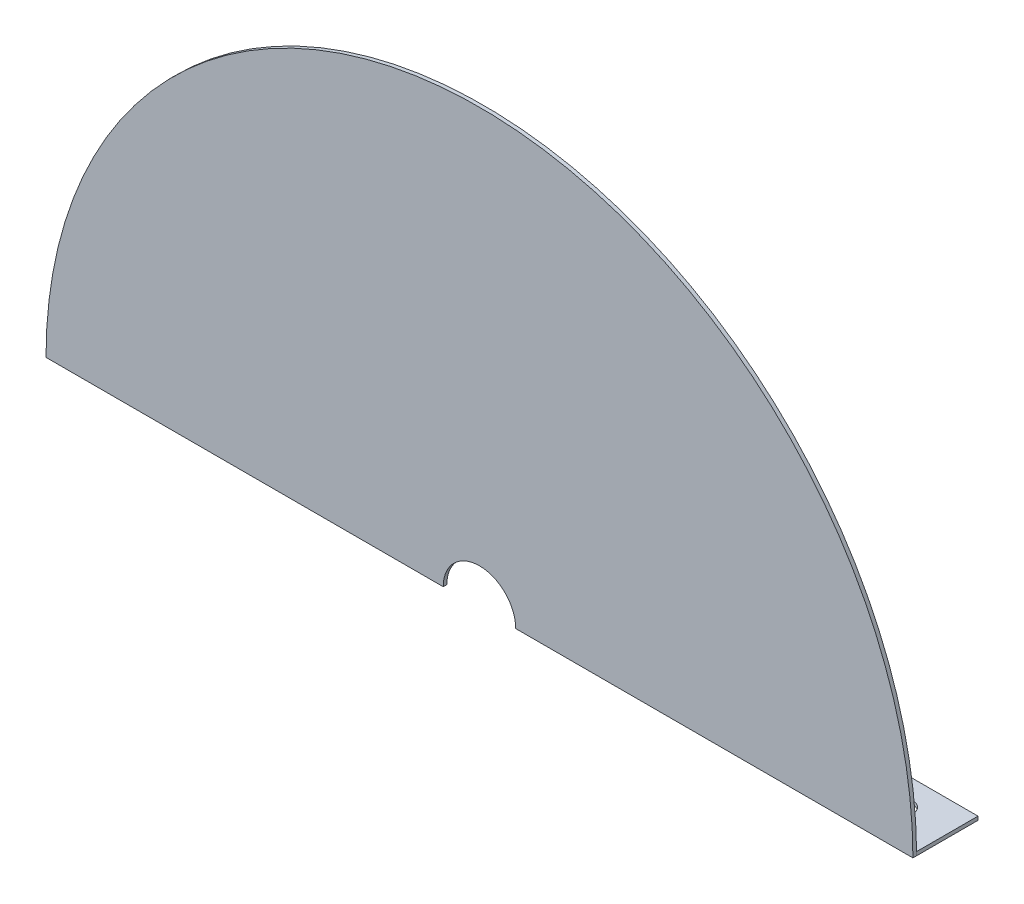
ISO-10303-21;
HEADER;
FILE_DESCRIPTION(('STEP AP214'),'2;1');
FILE_NAME('part.step','',(''),(''),'','','');
FILE_SCHEMA(('AUTOMOTIVE_DESIGN { 1 0 10303 214 1 1 1 1 }'));
ENDSEC;
DATA;
#1=APPLICATION_CONTEXT('core data for automotive mechanical design processes');
#2=APPLICATION_PROTOCOL_DEFINITION('international standard','automotive_design',2000,#1);
#3=PRODUCT_CONTEXT('',#1,'mechanical');
#4=PRODUCT('Part','Part','',(#3));
#5=PRODUCT_RELATED_PRODUCT_CATEGORY('part','',(#4));
#6=PRODUCT_DEFINITION_FORMATION('','',#4);
#7=PRODUCT_DEFINITION_CONTEXT('part definition',#1,'design');
#8=PRODUCT_DEFINITION('design','',#6,#7);
#9=PRODUCT_DEFINITION_SHAPE('','',#8);
#10=(LENGTH_UNIT() NAMED_UNIT(*) SI_UNIT(.MILLI.,.METRE.));
#11=(NAMED_UNIT(*) PLANE_ANGLE_UNIT() SI_UNIT($,.RADIAN.));
#12=(NAMED_UNIT(*) SI_UNIT($,.STERADIAN.) SOLID_ANGLE_UNIT());
#13=UNCERTAINTY_MEASURE_WITH_UNIT(LENGTH_MEASURE(1.E-05),#10,'distance_accuracy_value','');
#14=(GEOMETRIC_REPRESENTATION_CONTEXT(3) GLOBAL_UNCERTAINTY_ASSIGNED_CONTEXT((#13)) GLOBAL_UNIT_ASSIGNED_CONTEXT((#10,
#11,#12)) REPRESENTATION_CONTEXT('',''));
#15=CARTESIAN_POINT('',(0.,0.,0.));
#16=DIRECTION('',(0.,0.,1.));
#17=DIRECTION('',(1.,0.,0.));
#18=AXIS2_PLACEMENT_3D('',#15,#16,#17);
#19=CARTESIAN_POINT('',(0.,179.31892,0.));
#20=DIRECTION('',(0.,0.,-1.));
#21=DIRECTION('',(-1.,0.,0.));
#22=AXIS2_PLACEMENT_3D('',#19,#20,#21);
#23=PLANE('',#22);
#24=DIRECTION('',(0.,-1.,0.));
#25=VECTOR('',#24,1.);
#26=CARTESIAN_POINT('',(-103.11892,179.31892,0.));
#27=LINE('',#26,#25);
#28=CARTESIAN_POINT('',(-103.11892,180.83784,0.));
#29=VERTEX_POINT('',#28);
#30=CARTESIAN_POINT('',(-103.11892,179.31892,0.));
#31=VERTEX_POINT('',#30);
#32=EDGE_CURVE('E152',#29,#31,#27,.T.);
#33=ORIENTED_EDGE('',*,*,#32,.F.);
#34=DIRECTION('',(-1.,0.,0.));
#35=VECTOR('',#34,1.);
#36=CARTESIAN_POINT('',(0.,180.83784,0.));
#37=LINE('',#36,#35);
#38=CARTESIAN_POINT('',(-179.312486882537,180.83784,0.));
#39=VERTEX_POINT('',#38);
#40=EDGE_CURVE('E11',#29,#39,#37,.T.);
#41=ORIENTED_EDGE('',*,*,#40,.T.);
#42=CARTESIAN_POINT('',(0.,179.31892,0.));
#43=DIRECTION('',(0.,0.,1.));
#44=DIRECTION('',(-1.,0.,0.));
#45=AXIS2_PLACEMENT_3D('',#42,#43,#44);
#46=CIRCLE('',#45,179.31892);
#47=CARTESIAN_POINT('',(179.312486882537,180.83784,0.));
#48=VERTEX_POINT('',#47);
#49=EDGE_CURVE('E230',#48,#39,#46,.T.);
#50=ORIENTED_EDGE('',*,*,#49,.F.);
#51=DIRECTION('',(1.,0.,0.));
#52=VECTOR('',#51,1.);
#53=CARTESIAN_POINT('',(103.11892,180.83784,0.));
#54=LINE('',#53,#52);
#55=CARTESIAN_POINT('',(103.11892,180.83784,0.));
#56=VERTEX_POINT('',#55);
#57=EDGE_CURVE('E172',#56,#48,#54,.T.);
#58=ORIENTED_EDGE('',*,*,#57,.F.);
#59=DIRECTION('',(0.,1.,0.));
#60=VECTOR('',#59,1.);
#61=CARTESIAN_POINT('',(103.11892,179.31892,0.));
#62=LINE('',#61,#60);
#63=CARTESIAN_POINT('',(103.11892,179.31892,0.));
#64=VERTEX_POINT('',#63);
#65=EDGE_CURVE('E63',#64,#56,#62,.T.);
#66=ORIENTED_EDGE('',*,*,#65,.F.);
#67=DIRECTION('',(1.,0.,0.));
#68=VECTOR('',#67,1.);
#69=CARTESIAN_POINT('',(0.,179.31892,0.));
#70=LINE('',#69,#68);
#71=CARTESIAN_POINT('',(15.,179.31892,0.));
#72=VERTEX_POINT('',#71);
#73=EDGE_CURVE('E229',#72,#64,#70,.T.);
#74=ORIENTED_EDGE('',*,*,#73,.F.);
#75=CARTESIAN_POINT('',(0.,179.31892,0.));
#76=DIRECTION('',(0.,0.,-1.));
#77=DIRECTION('',(-1.,0.,0.));
#78=AXIS2_PLACEMENT_3D('',#75,#76,#77);
#79=CIRCLE('',#78,15.);
#80=CARTESIAN_POINT('',(-15.,179.31892,0.));
#81=VERTEX_POINT('',#80);
#82=EDGE_CURVE('E48',#81,#72,#79,.T.);
#83=ORIENTED_EDGE('',*,*,#82,.F.);
#84=EDGE_CURVE('E231',#31,#81,#70,.T.);
#85=ORIENTED_EDGE('',*,*,#84,.F.);
#86=EDGE_LOOP('',(#33,#41,#50,#58,#66,#74,#83,#85));
#87=FACE_BOUND('',#86,.T.);
#88=ADVANCED_FACE('F39',(#87),#23,.T.);
#89=CARTESIAN_POINT('',(0.,179.31892,1.51892));
#90=DIRECTION('',(0.,1.,0.));
#91=DIRECTION('',(0.,0.,1.));
#92=AXIS2_PLACEMENT_3D('',#89,#90,#91);
#93=PLANE('',#92);
#94=CARTESIAN_POINT('',(-122.16892,179.31892,-12.7));
#95=DIRECTION('',(0.,1.,0.));
#96=DIRECTION('',(0.,0.,-1.));
#97=AXIS2_PLACEMENT_3D('',#94,#95,#96);
#98=CIRCLE('',#97,4.7625);
#99=CARTESIAN_POINT('',(-122.16892,179.31892,-17.4625));
#100=VERTEX_POINT('',#99);
#101=EDGE_CURVE('E334',#100,#100,#98,.T.);
#102=ORIENTED_EDGE('',*,*,#101,.T.);
#103=EDGE_LOOP('',(#102));
#104=FACE_BOUND('',#103,.T.);
#105=CARTESIAN_POINT('',(-160.26892,179.31892,-12.7));
#106=DIRECTION('',(0.,1.,0.));
#107=DIRECTION('',(0.,0.,-1.));
#108=AXIS2_PLACEMENT_3D('',#105,#106,#107);
#109=CIRCLE('',#108,4.76250000000001);
#110=CARTESIAN_POINT('',(-160.26892,179.31892,-17.4625));
#111=VERTEX_POINT('',#110);
#112=EDGE_CURVE('E322',#111,#111,#109,.T.);
#113=ORIENTED_EDGE('',*,*,#112,.T.);
#114=EDGE_LOOP('',(#113));
#115=FACE_BOUND('',#114,.T.);
#116=DIRECTION('',(0.,0.,-1.));
#117=VECTOR('',#116,1.);
#118=CARTESIAN_POINT('',(-179.31892,179.31892,1.51892));
#119=LINE('',#118,#117);
#120=CARTESIAN_POINT('',(-179.31892,179.31892,1.51892));
#121=VERTEX_POINT('',#120);
#122=CARTESIAN_POINT('',(-179.31892,179.31892,0.));
#123=VERTEX_POINT('',#122);
#124=EDGE_CURVE('E224',#121,#123,#119,.T.);
#125=ORIENTED_EDGE('',*,*,#124,.T.);
#126=DIRECTION('',(0.,0.,1.));
#127=VECTOR('',#126,1.);
#128=CARTESIAN_POINT('',(-179.31892,179.31892,-25.4));
#129=LINE('',#128,#127);
#130=CARTESIAN_POINT('',(-179.31892,179.31892,-25.4));
#131=VERTEX_POINT('',#130);
#132=EDGE_CURVE('E340',#131,#123,#129,.T.);
#133=ORIENTED_EDGE('',*,*,#132,.F.);
#134=DIRECTION('',(-1.,0.,0.));
#135=VECTOR('',#134,1.);
#136=CARTESIAN_POINT('',(-179.31892,179.31892,-25.4));
#137=LINE('',#136,#135);
#138=CARTESIAN_POINT('',(-103.11892,179.31892,-25.4));
#139=VERTEX_POINT('',#138);
#140=EDGE_CURVE('E148',#139,#131,#137,.T.);
#141=ORIENTED_EDGE('',*,*,#140,.F.);
#142=DIRECTION('',(0.,0.,1.));
#143=VECTOR('',#142,1.);
#144=CARTESIAN_POINT('',(-103.11892,179.31892,-25.4));
#145=LINE('',#144,#143);
#146=EDGE_CURVE('E55',#139,#31,#145,.T.);
#147=ORIENTED_EDGE('',*,*,#146,.T.);
#148=ORIENTED_EDGE('',*,*,#84,.T.);
#149=DIRECTION('',(0.,0.,1.));
#150=VECTOR('',#149,1.);
#151=CARTESIAN_POINT('',(-15.,179.31892,-18.48108));
#152=LINE('',#151,#150);
#153=CARTESIAN_POINT('',(-15.,179.31892,1.51892));
#154=VERTEX_POINT('',#153);
#155=EDGE_CURVE('E210',#81,#154,#152,.T.);
#156=ORIENTED_EDGE('',*,*,#155,.T.);
#157=DIRECTION('',(1.,0.,0.));
#158=VECTOR('',#157,1.);
#159=CARTESIAN_POINT('',(0.,179.31892,1.51892));
#160=LINE('',#159,#158);
#161=EDGE_CURVE('E215',#121,#154,#160,.T.);
#162=ORIENTED_EDGE('',*,*,#161,.F.);
#163=EDGE_LOOP('',(#125,#133,#141,#147,#148,#156,#162));
#164=FACE_BOUND('',#163,.T.);
#165=ADVANCED_FACE('F289',(#104,#115,#164),#93,.F.);
#166=CARTESIAN_POINT('',(0.,179.31892,1.51892));
#167=DIRECTION('',(0.,0.,-1.));
#168=DIRECTION('',(-1.,0.,0.));
#169=AXIS2_PLACEMENT_3D('',#166,#167,#168);
#170=CYLINDRICAL_SURFACE('',#169,179.31892);
#171=CARTESIAN_POINT('',(179.31892,179.31892,0.));
#172=VERTEX_POINT('',#171);
#173=EDGE_CURVE('E225',#172,#48,#46,.T.);
#174=ORIENTED_EDGE('',*,*,#173,.T.);
#175=ORIENTED_EDGE('',*,*,#49,.T.);
#176=EDGE_CURVE('E214',#39,#123,#46,.T.);
#177=ORIENTED_EDGE('',*,*,#176,.T.);
#178=ORIENTED_EDGE('',*,*,#124,.F.);
#179=CARTESIAN_POINT('',(0.,179.31892,1.51892));
#180=DIRECTION('',(0.,0.,1.));
#181=DIRECTION('',(-1.,0.,0.));
#182=AXIS2_PLACEMENT_3D('',#179,#180,#181);
#183=CIRCLE('',#182,179.31892);
#184=CARTESIAN_POINT('',(179.31892,179.31892,1.51892));
#185=VERTEX_POINT('',#184);
#186=EDGE_CURVE('E219',#185,#121,#183,.T.);
#187=ORIENTED_EDGE('',*,*,#186,.F.);
#188=DIRECTION('',(0.,0.,-1.));
#189=VECTOR('',#188,1.);
#190=CARTESIAN_POINT('',(179.31892,179.31892,1.51892));
#191=LINE('',#190,#189);
#192=EDGE_CURVE('E237',#185,#172,#191,.T.);
#193=ORIENTED_EDGE('',*,*,#192,.T.);
#194=EDGE_LOOP('',(#174,#175,#177,#178,#187,#193));
#195=FACE_BOUND('',#194,.T.);
#196=ADVANCED_FACE('F41',(#195),#170,.T.);
#197=CARTESIAN_POINT('',(160.26892,179.31892,-12.7));
#198=DIRECTION('',(0.,1.,0.));
#199=DIRECTION('',(0.,0.,1.));
#200=AXIS2_PLACEMENT_3D('',#197,#198,#199);
#201=CIRCLE('',#200,4.76250000000001);
#202=CARTESIAN_POINT('',(160.26892,179.31892,-7.9375));
#203=VERTEX_POINT('',#202);
#204=EDGE_CURVE('E308',#203,#203,#201,.T.);
#205=ORIENTED_EDGE('',*,*,#204,.T.);
#206=EDGE_LOOP('',(#205));
#207=FACE_BOUND('',#206,.T.);
#208=CARTESIAN_POINT('',(122.16892,179.31892,-12.7));
#209=DIRECTION('',(0.,1.,0.));
#210=DIRECTION('',(0.,0.,1.));
#211=AXIS2_PLACEMENT_3D('',#208,#209,#210);
#212=CIRCLE('',#211,4.76250000000001);
#213=CARTESIAN_POINT('',(122.16892,179.31892,-7.93749999999999));
#214=VERTEX_POINT('',#213);
#215=EDGE_CURVE('E311',#214,#214,#212,.T.);
#216=ORIENTED_EDGE('',*,*,#215,.T.);
#217=EDGE_LOOP('',(#216));
#218=FACE_BOUND('',#217,.T.);
#219=CARTESIAN_POINT('',(15.,179.31892,1.51892));
#220=VERTEX_POINT('',#219);
#221=EDGE_CURVE('E220',#220,#185,#160,.T.);
#222=ORIENTED_EDGE('',*,*,#221,.F.);
#223=DIRECTION('',(0.,0.,1.));
#224=VECTOR('',#223,1.);
#225=CARTESIAN_POINT('',(15.,179.31892,-18.48108));
#226=LINE('',#225,#224);
#227=EDGE_CURVE('E206',#220,#72,#226,.F.);
#228=ORIENTED_EDGE('',*,*,#227,.T.);
#229=ORIENTED_EDGE('',*,*,#73,.T.);
#230=DIRECTION('',(0.,0.,1.));
#231=VECTOR('',#230,1.);
#232=CARTESIAN_POINT('',(103.11892,179.31892,-25.4));
#233=LINE('',#232,#231);
#234=CARTESIAN_POINT('',(103.11892,179.31892,-25.4));
#235=VERTEX_POINT('',#234);
#236=EDGE_CURVE('E195',#235,#64,#233,.T.);
#237=ORIENTED_EDGE('',*,*,#236,.F.);
#238=DIRECTION('',(-1.,0.,0.));
#239=VECTOR('',#238,1.);
#240=CARTESIAN_POINT('',(179.31892,179.31892,-25.4));
#241=LINE('',#240,#239);
#242=CARTESIAN_POINT('',(179.31892,179.31892,-25.4));
#243=VERTEX_POINT('',#242);
#244=EDGE_CURVE('E171',#243,#235,#241,.T.);
#245=ORIENTED_EDGE('',*,*,#244,.F.);
#246=DIRECTION('',(0.,0.,1.));
#247=VECTOR('',#246,1.);
#248=CARTESIAN_POINT('',(179.31892,179.31892,-25.4));
#249=LINE('',#248,#247);
#250=EDGE_CURVE('E199',#243,#172,#249,.T.);
#251=ORIENTED_EDGE('',*,*,#250,.T.);
#252=ORIENTED_EDGE('',*,*,#192,.F.);
#253=EDGE_LOOP('',(#222,#228,#229,#237,#245,#251,#252));
#254=FACE_BOUND('',#253,.T.);
#255=ADVANCED_FACE('F248',(#207,#218,#254),#93,.F.);
#256=CARTESIAN_POINT('',(0.,179.31892,1.51892));
#257=DIRECTION('',(0.,0.,-1.));
#258=DIRECTION('',(-1.,0.,0.));
#259=AXIS2_PLACEMENT_3D('',#256,#257,#258);
#260=PLANE('',#259);
#261=ORIENTED_EDGE('',*,*,#161,.T.);
#262=CARTESIAN_POINT('',(0.,179.31892,1.51892));
#263=DIRECTION('',(0.,0.,1.));
#264=DIRECTION('',(1.,0.,0.));
#265=AXIS2_PLACEMENT_3D('',#262,#263,#264);
#266=CIRCLE('',#265,15.);
#267=EDGE_CURVE('E203',#220,#154,#266,.T.);
#268=ORIENTED_EDGE('',*,*,#267,.F.);
#269=ORIENTED_EDGE('',*,*,#221,.T.);
#270=ORIENTED_EDGE('',*,*,#186,.T.);
#271=EDGE_LOOP('',(#261,#268,#269,#270));
#272=FACE_BOUND('',#271,.T.);
#273=ADVANCED_FACE('F296',(#272),#260,.F.);
#274=CARTESIAN_POINT('',(0.,179.31892,-18.48108));
#275=DIRECTION('',(0.,0.,1.));
#276=DIRECTION('',(1.,0.,0.));
#277=AXIS2_PLACEMENT_3D('',#274,#275,#276);
#278=CYLINDRICAL_SURFACE('',#277,15.);
#279=ORIENTED_EDGE('',*,*,#82,.T.);
#280=ORIENTED_EDGE('',*,*,#227,.F.);
#281=ORIENTED_EDGE('',*,*,#267,.T.);
#282=ORIENTED_EDGE('',*,*,#155,.F.);
#283=EDGE_LOOP('',(#279,#280,#281,#282));
#284=FACE_BOUND('',#283,.T.);
#285=ADVANCED_FACE('F243',(#284),#278,.F.);
#286=CARTESIAN_POINT('',(179.31892,180.83784,-25.4));
#287=DIRECTION('',(-1.,0.,0.));
#288=DIRECTION('',(0.,0.,1.));
#289=AXIS2_PLACEMENT_3D('',#286,#287,#288);
#290=PLANE('',#289);
#291=DIRECTION('',(0.,-1.,0.));
#292=VECTOR('',#291,1.);
#293=CARTESIAN_POINT('',(179.31892,180.83784,0.));
#294=LINE('',#293,#292);
#295=CARTESIAN_POINT('',(179.31892,180.83784,0.));
#296=VERTEX_POINT('',#295);
#297=EDGE_CURVE('E158',#296,#172,#294,.T.);
#298=ORIENTED_EDGE('',*,*,#297,.T.);
#299=ORIENTED_EDGE('',*,*,#250,.F.);
#300=DIRECTION('',(0.,-1.,0.));
#301=VECTOR('',#300,1.);
#302=CARTESIAN_POINT('',(179.31892,180.83784,-25.4));
#303=LINE('',#302,#301);
#304=CARTESIAN_POINT('',(179.31892,180.83784,-25.4));
#305=VERTEX_POINT('',#304);
#306=EDGE_CURVE('E167',#305,#243,#303,.T.);
#307=ORIENTED_EDGE('',*,*,#306,.F.);
#308=DIRECTION('',(0.,0.,1.));
#309=VECTOR('',#308,1.);
#310=CARTESIAN_POINT('',(179.31892,180.83784,-25.4));
#311=LINE('',#310,#309);
#312=EDGE_CURVE('E180',#305,#296,#311,.T.);
#313=ORIENTED_EDGE('',*,*,#312,.T.);
#314=EDGE_LOOP('',(#298,#299,#307,#313));
#315=FACE_BOUND('',#314,.T.);
#316=ADVANCED_FACE('F269',(#315),#290,.F.);
#317=CARTESIAN_POINT('',(103.11892,179.31892,-25.4));
#318=DIRECTION('',(1.,0.,0.));
#319=DIRECTION('',(0.,0.,-1.));
#320=AXIS2_PLACEMENT_3D('',#317,#318,#319);
#321=PLANE('',#320);
#322=ORIENTED_EDGE('',*,*,#65,.T.);
#323=DIRECTION('',(0.,0.,1.));
#324=VECTOR('',#323,1.);
#325=CARTESIAN_POINT('',(103.11892,180.83784,-25.4));
#326=LINE('',#325,#324);
#327=CARTESIAN_POINT('',(103.11892,180.83784,-25.4));
#328=VERTEX_POINT('',#327);
#329=EDGE_CURVE('E191',#328,#56,#326,.T.);
#330=ORIENTED_EDGE('',*,*,#329,.F.);
#331=DIRECTION('',(0.,1.,0.));
#332=VECTOR('',#331,1.);
#333=CARTESIAN_POINT('',(103.11892,179.31892,-25.4));
#334=LINE('',#333,#332);
#335=EDGE_CURVE('E175',#235,#328,#334,.T.);
#336=ORIENTED_EDGE('',*,*,#335,.F.);
#337=ORIENTED_EDGE('',*,*,#236,.T.);
#338=EDGE_LOOP('',(#322,#330,#336,#337));
#339=FACE_BOUND('',#338,.T.);
#340=ADVANCED_FACE('F278',(#339),#321,.F.);
#341=CARTESIAN_POINT('',(103.11892,180.83784,-25.4));
#342=DIRECTION('',(0.,-1.,0.));
#343=DIRECTION('',(0.,0.,-1.));
#344=AXIS2_PLACEMENT_3D('',#341,#342,#343);
#345=PLANE('',#344);
#346=CARTESIAN_POINT('',(160.26892,180.83784,-12.7));
#347=DIRECTION('',(0.,1.,0.));
#348=DIRECTION('',(0.,0.,1.));
#349=AXIS2_PLACEMENT_3D('',#346,#347,#348);
#350=CIRCLE('',#349,4.76250000000001);
#351=CARTESIAN_POINT('',(160.26892,180.83784,-7.9375));
#352=VERTEX_POINT('',#351);
#353=EDGE_CURVE('E314',#352,#352,#350,.T.);
#354=ORIENTED_EDGE('',*,*,#353,.F.);
#355=EDGE_LOOP('',(#354));
#356=FACE_BOUND('',#355,.T.);
#357=CARTESIAN_POINT('',(122.16892,180.83784,-12.7));
#358=DIRECTION('',(0.,1.,0.));
#359=DIRECTION('',(0.,0.,1.));
#360=AXIS2_PLACEMENT_3D('',#357,#358,#359);
#361=CIRCLE('',#360,4.76250000000001);
#362=CARTESIAN_POINT('',(122.16892,180.83784,-7.93749999999999));
#363=VERTEX_POINT('',#362);
#364=EDGE_CURVE('E315',#363,#363,#361,.T.);
#365=ORIENTED_EDGE('',*,*,#364,.F.);
#366=EDGE_LOOP('',(#365));
#367=FACE_BOUND('',#366,.T.);
#368=ORIENTED_EDGE('',*,*,#57,.T.);
#369=EDGE_CURVE('E184',#48,#296,#54,.T.);
#370=ORIENTED_EDGE('',*,*,#369,.T.);
#371=ORIENTED_EDGE('',*,*,#312,.F.);
#372=DIRECTION('',(1.,0.,0.));
#373=VECTOR('',#372,1.);
#374=CARTESIAN_POINT('',(103.11892,180.83784,-25.4));
#375=LINE('',#374,#373);
#376=EDGE_CURVE('E178',#328,#305,#375,.T.);
#377=ORIENTED_EDGE('',*,*,#376,.F.);
#378=ORIENTED_EDGE('',*,*,#329,.T.);
#379=EDGE_LOOP('',(#368,#370,#371,#377,#378));
#380=FACE_BOUND('',#379,.T.);
#381=ADVANCED_FACE('F262',(#356,#367,#380),#345,.F.);
#382=CARTESIAN_POINT('',(0.,0.,-25.4));
#383=DIRECTION('',(0.,0.,-1.));
#384=DIRECTION('',(-1.,0.,0.));
#385=AXIS2_PLACEMENT_3D('',#382,#383,#384);
#386=PLANE('',#385);
#387=ORIENTED_EDGE('',*,*,#306,.T.);
#388=ORIENTED_EDGE('',*,*,#244,.T.);
#389=ORIENTED_EDGE('',*,*,#335,.T.);
#390=ORIENTED_EDGE('',*,*,#376,.T.);
#391=EDGE_LOOP('',(#387,#388,#389,#390));
#392=FACE_BOUND('',#391,.T.);
#393=ADVANCED_FACE('F275',(#392),#386,.T.);
#394=CARTESIAN_POINT('',(0.,0.,0.));
#395=DIRECTION('',(0.,0.,-1.));
#396=DIRECTION('',(-1.,0.,0.));
#397=AXIS2_PLACEMENT_3D('',#394,#395,#396);
#398=PLANE('',#397);
#399=ORIENTED_EDGE('',*,*,#173,.F.);
#400=ORIENTED_EDGE('',*,*,#297,.F.);
#401=ORIENTED_EDGE('',*,*,#369,.F.);
#402=EDGE_LOOP('',(#399,#400,#401));
#403=FACE_BOUND('',#402,.T.);
#404=ADVANCED_FACE('F271',(#403),#398,.F.);
#405=CARTESIAN_POINT('',(-179.31892,180.83784,-25.4));
#406=DIRECTION('',(1.,0.,0.));
#407=DIRECTION('',(0.,0.,-1.));
#408=AXIS2_PLACEMENT_3D('',#405,#406,#407);
#409=PLANE('',#408);
#410=DIRECTION('',(0.,1.,0.));
#411=VECTOR('',#410,1.);
#412=CARTESIAN_POINT('',(-179.31892,180.83784,0.));
#413=LINE('',#412,#411);
#414=CARTESIAN_POINT('',(-179.31892,180.83784,0.));
#415=VERTEX_POINT('',#414);
#416=EDGE_CURVE('E156',#123,#415,#413,.T.);
#417=ORIENTED_EDGE('',*,*,#416,.T.);
#418=DIRECTION('',(0.,0.,1.));
#419=VECTOR('',#418,1.);
#420=CARTESIAN_POINT('',(-179.31892,180.83784,-25.4));
#421=LINE('',#420,#419);
#422=CARTESIAN_POINT('',(-179.31892,180.83784,-25.4));
#423=VERTEX_POINT('',#422);
#424=EDGE_CURVE('E136',#423,#415,#421,.T.);
#425=ORIENTED_EDGE('',*,*,#424,.F.);
#426=DIRECTION('',(0.,1.,0.));
#427=VECTOR('',#426,1.);
#428=CARTESIAN_POINT('',(-179.31892,180.83784,-25.4));
#429=LINE('',#428,#427);
#430=EDGE_CURVE('E144',#131,#423,#429,.T.);
#431=ORIENTED_EDGE('',*,*,#430,.F.);
#432=ORIENTED_EDGE('',*,*,#132,.T.);
#433=EDGE_LOOP('',(#417,#425,#431,#432));
#434=FACE_BOUND('',#433,.T.);
#435=ADVANCED_FACE('F154',(#434),#409,.F.);
#436=CARTESIAN_POINT('',(-103.11892,180.83784,-25.4));
#437=DIRECTION('',(0.,-1.,0.));
#438=DIRECTION('',(0.,0.,-1.));
#439=AXIS2_PLACEMENT_3D('',#436,#437,#438);
#440=PLANE('',#439);
#441=CARTESIAN_POINT('',(-122.16892,180.83784,-12.7));
#442=DIRECTION('',(0.,1.,0.));
#443=DIRECTION('',(0.,0.,-1.));
#444=AXIS2_PLACEMENT_3D('',#441,#442,#443);
#445=CIRCLE('',#444,4.7625);
#446=CARTESIAN_POINT('',(-122.16892,180.83784,-17.4625));
#447=VERTEX_POINT('',#446);
#448=EDGE_CURVE('E325',#447,#447,#445,.T.);
#449=ORIENTED_EDGE('',*,*,#448,.F.);
#450=EDGE_LOOP('',(#449));
#451=FACE_BOUND('',#450,.T.);
#452=CARTESIAN_POINT('',(-160.26892,180.83784,-12.7));
#453=DIRECTION('',(0.,1.,0.));
#454=DIRECTION('',(0.,0.,-1.));
#455=AXIS2_PLACEMENT_3D('',#452,#453,#454);
#456=CIRCLE('',#455,4.76250000000001);
#457=CARTESIAN_POINT('',(-160.26892,180.83784,-17.4625));
#458=VERTEX_POINT('',#457);
#459=EDGE_CURVE('E331',#458,#458,#456,.T.);
#460=ORIENTED_EDGE('',*,*,#459,.F.);
#461=EDGE_LOOP('',(#460));
#462=FACE_BOUND('',#461,.T.);
#463=DIRECTION('',(1.,0.,0.));
#464=VECTOR('',#463,1.);
#465=CARTESIAN_POINT('',(-103.11892,180.83784,0.));
#466=LINE('',#465,#464);
#467=EDGE_CURVE('E343',#415,#39,#466,.T.);
#468=ORIENTED_EDGE('',*,*,#467,.T.);
#469=ORIENTED_EDGE('',*,*,#40,.F.);
#470=DIRECTION('',(0.,0.,1.));
#471=VECTOR('',#470,1.);
#472=CARTESIAN_POINT('',(-103.11892,180.83784,-25.4));
#473=LINE('',#472,#471);
#474=CARTESIAN_POINT('',(-103.11892,180.83784,-25.4));
#475=VERTEX_POINT('',#474);
#476=EDGE_CURVE('E139',#475,#29,#473,.T.);
#477=ORIENTED_EDGE('',*,*,#476,.F.);
#478=DIRECTION('',(1.,0.,0.));
#479=VECTOR('',#478,1.);
#480=CARTESIAN_POINT('',(-103.11892,180.83784,-25.4));
#481=LINE('',#480,#479);
#482=EDGE_CURVE('E131',#423,#475,#481,.T.);
#483=ORIENTED_EDGE('',*,*,#482,.F.);
#484=ORIENTED_EDGE('',*,*,#424,.T.);
#485=EDGE_LOOP('',(#468,#469,#477,#483,#484));
#486=FACE_BOUND('',#485,.T.);
#487=ADVANCED_FACE('F134',(#451,#462,#486),#440,.F.);
#488=CARTESIAN_POINT('',(-103.11892,179.31892,-25.4));
#489=DIRECTION('',(-1.,0.,0.));
#490=DIRECTION('',(0.,0.,1.));
#491=AXIS2_PLACEMENT_3D('',#488,#489,#490);
#492=PLANE('',#491);
#493=ORIENTED_EDGE('',*,*,#32,.T.);
#494=ORIENTED_EDGE('',*,*,#146,.F.);
#495=DIRECTION('',(0.,-1.,0.));
#496=VECTOR('',#495,1.);
#497=CARTESIAN_POINT('',(-103.11892,179.31892,-25.4));
#498=LINE('',#497,#496);
#499=EDGE_CURVE('E143',#475,#139,#498,.T.);
#500=ORIENTED_EDGE('',*,*,#499,.F.);
#501=ORIENTED_EDGE('',*,*,#476,.T.);
#502=EDGE_LOOP('',(#493,#494,#500,#501));
#503=FACE_BOUND('',#502,.T.);
#504=ADVANCED_FACE('F363',(#503),#492,.F.);
#505=CARTESIAN_POINT('',(0.,0.,-25.4));
#506=DIRECTION('',(0.,0.,1.));
#507=DIRECTION('',(1.,0.,0.));
#508=AXIS2_PLACEMENT_3D('',#505,#506,#507);
#509=PLANE('',#508);
#510=ORIENTED_EDGE('',*,*,#430,.T.);
#511=ORIENTED_EDGE('',*,*,#482,.T.);
#512=ORIENTED_EDGE('',*,*,#499,.T.);
#513=ORIENTED_EDGE('',*,*,#140,.T.);
#514=EDGE_LOOP('',(#510,#511,#512,#513));
#515=FACE_BOUND('',#514,.T.);
#516=ADVANCED_FACE('F147',(#515),#509,.F.);
#517=CARTESIAN_POINT('',(0.,0.,0.));
#518=DIRECTION('',(0.,0.,1.));
#519=DIRECTION('',(1.,0.,0.));
#520=AXIS2_PLACEMENT_3D('',#517,#518,#519);
#521=PLANE('',#520);
#522=ORIENTED_EDGE('',*,*,#176,.F.);
#523=ORIENTED_EDGE('',*,*,#467,.F.);
#524=ORIENTED_EDGE('',*,*,#416,.F.);
#525=EDGE_LOOP('',(#522,#523,#524));
#526=FACE_BOUND('',#525,.T.);
#527=ADVANCED_FACE('F369',(#526),#521,.T.);
#528=CARTESIAN_POINT('',(-160.26892,179.31892,-12.7));
#529=DIRECTION('',(0.,1.,0.));
#530=DIRECTION('',(0.,0.,1.));
#531=AXIS2_PLACEMENT_3D('',#528,#529,#530);
#532=CYLINDRICAL_SURFACE('',#531,4.76250000000001);
#533=ORIENTED_EDGE('',*,*,#112,.F.);
#534=EDGE_LOOP('',(#533));
#535=FACE_BOUND('',#534,.T.);
#536=ORIENTED_EDGE('',*,*,#459,.T.);
#537=EDGE_LOOP('',(#536));
#538=FACE_BOUND('',#537,.T.);
#539=ADVANCED_FACE('F367',(#535,#538),#532,.F.);
#540=CARTESIAN_POINT('',(-122.16892,179.31892,-12.7));
#541=DIRECTION('',(0.,1.,0.));
#542=DIRECTION('',(0.,0.,1.));
#543=AXIS2_PLACEMENT_3D('',#540,#541,#542);
#544=CYLINDRICAL_SURFACE('',#543,4.7625);
#545=ORIENTED_EDGE('',*,*,#101,.F.);
#546=EDGE_LOOP('',(#545));
#547=FACE_BOUND('',#546,.T.);
#548=ORIENTED_EDGE('',*,*,#448,.T.);
#549=EDGE_LOOP('',(#548));
#550=FACE_BOUND('',#549,.T.);
#551=ADVANCED_FACE('F359',(#547,#550),#544,.F.);
#552=CARTESIAN_POINT('',(122.16892,179.31892,-12.7));
#553=DIRECTION('',(0.,1.,0.));
#554=DIRECTION('',(0.,0.,1.));
#555=AXIS2_PLACEMENT_3D('',#552,#553,#554);
#556=CYLINDRICAL_SURFACE('',#555,4.76250000000001);
#557=ORIENTED_EDGE('',*,*,#215,.F.);
#558=EDGE_LOOP('',(#557));
#559=FACE_BOUND('',#558,.T.);
#560=ORIENTED_EDGE('',*,*,#364,.T.);
#561=EDGE_LOOP('',(#560));
#562=FACE_BOUND('',#561,.T.);
#563=ADVANCED_FACE('F376',(#559,#562),#556,.F.);
#564=CARTESIAN_POINT('',(160.26892,179.31892,-12.7));
#565=DIRECTION('',(0.,1.,0.));
#566=DIRECTION('',(0.,0.,1.));
#567=AXIS2_PLACEMENT_3D('',#564,#565,#566);
#568=CYLINDRICAL_SURFACE('',#567,4.76250000000001);
#569=ORIENTED_EDGE('',*,*,#204,.F.);
#570=EDGE_LOOP('',(#569));
#571=FACE_BOUND('',#570,.T.);
#572=ORIENTED_EDGE('',*,*,#353,.T.);
#573=EDGE_LOOP('',(#572));
#574=FACE_BOUND('',#573,.T.);
#575=ADVANCED_FACE('F512',(#571,#574),#568,.F.);
#576=CLOSED_SHELL('',(#88,#165,#196,#255,#273,#285,#316,#340,#381,#393,#404,#435,#487,#504,#516,
#527,#539,#551,#563,#575));
#577=MANIFOLD_SOLID_BREP('B2',#576);
#578=ADVANCED_BREP_SHAPE_REPRESENTATION('',(#18,#577),#14);
#579=SHAPE_DEFINITION_REPRESENTATION(#9,#578);
ENDSEC;
END-ISO-10303-21;
